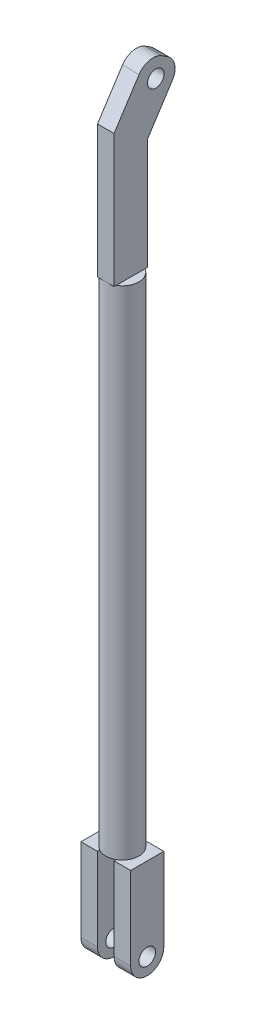
ISO-10303-21;
HEADER;
FILE_DESCRIPTION(('STEP AP214'),'2;1');
FILE_NAME('part.step','',(''),(''),'','','');
FILE_SCHEMA(('AUTOMOTIVE_DESIGN { 1 0 10303 214 1 1 1 1 }'));
ENDSEC;
DATA;
#1=APPLICATION_CONTEXT('core data for automotive mechanical design processes');
#2=APPLICATION_PROTOCOL_DEFINITION('international standard','automotive_design',2000,#1);
#3=PRODUCT_CONTEXT('',#1,'mechanical');
#4=PRODUCT('Part','Part','',(#3));
#5=PRODUCT_RELATED_PRODUCT_CATEGORY('part','',(#4));
#6=PRODUCT_DEFINITION_FORMATION('','',#4);
#7=PRODUCT_DEFINITION_CONTEXT('part definition',#1,'design');
#8=PRODUCT_DEFINITION('design','',#6,#7);
#9=PRODUCT_DEFINITION_SHAPE('','',#8);
#10=(LENGTH_UNIT() NAMED_UNIT(*) SI_UNIT(.MILLI.,.METRE.));
#11=(NAMED_UNIT(*) PLANE_ANGLE_UNIT() SI_UNIT($,.RADIAN.));
#12=(NAMED_UNIT(*) SI_UNIT($,.STERADIAN.) SOLID_ANGLE_UNIT());
#13=UNCERTAINTY_MEASURE_WITH_UNIT(LENGTH_MEASURE(1.E-05),#10,'distance_accuracy_value','');
#14=(GEOMETRIC_REPRESENTATION_CONTEXT(3) GLOBAL_UNCERTAINTY_ASSIGNED_CONTEXT((#13)) GLOBAL_UNIT_ASSIGNED_CONTEXT((#10,
#11,#12)) REPRESENTATION_CONTEXT('',''));
#15=CARTESIAN_POINT('',(0.,0.,0.));
#16=DIRECTION('',(0.,0.,1.));
#17=DIRECTION('',(1.,0.,0.));
#18=AXIS2_PLACEMENT_3D('',#15,#16,#17);
#19=CARTESIAN_POINT('',(0.,190.5,0.));
#20=DIRECTION('',(0.,1.,0.));
#21=DIRECTION('',(0.,0.,1.));
#22=AXIS2_PLACEMENT_3D('',#19,#20,#21);
#23=PLANE('',#22);
#24=CARTESIAN_POINT('',(0.,190.5,0.));
#25=DIRECTION('',(0.,1.,0.));
#26=DIRECTION('',(0.,0.,1.));
#27=AXIS2_PLACEMENT_3D('',#24,#25,#26);
#28=CIRCLE('',#27,12.7);
#29=CARTESIAN_POINT('',(-6.35,190.5,-10.9985226280624));
#30=VERTEX_POINT('',#29);
#31=CARTESIAN_POINT('',(-6.35,190.5,10.9985226280624));
#32=VERTEX_POINT('',#31);
#33=EDGE_CURVE('E392',#30,#32,#28,.T.);
#34=ORIENTED_EDGE('',*,*,#33,.T.);
#35=DIRECTION('',(0.,0.,-1.));
#36=VECTOR('',#35,1.);
#37=CARTESIAN_POINT('',(-6.35,190.5,12.7));
#38=LINE('',#37,#36);
#39=EDGE_CURVE('E268',#32,#30,#38,.T.);
#40=ORIENTED_EDGE('',*,*,#39,.T.);
#41=EDGE_LOOP('',(#34,#40));
#42=FACE_BOUND('',#41,.T.);
#43=ADVANCED_FACE('F30',(#42),#23,.T.);
#44=CARTESIAN_POINT('',(0.,-190.5,0.));
#45=DIRECTION('',(0.,1.,0.));
#46=DIRECTION('',(0.,0.,1.));
#47=AXIS2_PLACEMENT_3D('',#44,#45,#46);
#48=PLANE('',#47);
#49=DIRECTION('',(0.,0.,1.));
#50=VECTOR('',#49,1.);
#51=CARTESIAN_POINT('',(-6.35,-190.5,-12.7));
#52=LINE('',#51,#50);
#53=CARTESIAN_POINT('',(-6.35,-190.5,-10.9985226280624));
#54=VERTEX_POINT('',#53);
#55=CARTESIAN_POINT('',(-6.35,-190.5,10.9985226280624));
#56=VERTEX_POINT('',#55);
#57=EDGE_CURVE('E225',#54,#56,#52,.T.);
#58=ORIENTED_EDGE('',*,*,#57,.F.);
#59=CARTESIAN_POINT('',(0.,-190.5,0.));
#60=DIRECTION('',(0.,1.,0.));
#61=DIRECTION('',(0.,0.,1.));
#62=AXIS2_PLACEMENT_3D('',#59,#60,#61);
#63=CIRCLE('',#62,12.7);
#64=CARTESIAN_POINT('',(6.35,-190.5,-10.9985226280624));
#65=VERTEX_POINT('',#64);
#66=EDGE_CURVE('E264',#65,#54,#63,.T.);
#67=ORIENTED_EDGE('',*,*,#66,.F.);
#68=DIRECTION('',(0.,0.,-1.));
#69=VECTOR('',#68,1.);
#70=CARTESIAN_POINT('',(6.35,-190.5,-12.7));
#71=LINE('',#70,#69);
#72=CARTESIAN_POINT('',(6.35,-190.5,10.9985226280624));
#73=VERTEX_POINT('',#72);
#74=EDGE_CURVE('E247',#73,#65,#71,.T.);
#75=ORIENTED_EDGE('',*,*,#74,.F.);
#76=EDGE_CURVE('E258',#56,#73,#63,.T.);
#77=ORIENTED_EDGE('',*,*,#76,.F.);
#78=EDGE_LOOP('',(#58,#67,#75,#77));
#79=FACE_BOUND('',#78,.T.);
#80=ADVANCED_FACE('F441',(#79),#48,.F.);
#81=CARTESIAN_POINT('',(0.,190.5,0.));
#82=DIRECTION('',(0.,-1.,0.));
#83=DIRECTION('',(0.,0.,-1.));
#84=AXIS2_PLACEMENT_3D('',#81,#82,#83);
#85=CYLINDRICAL_SURFACE('',#84,12.7);
#86=CARTESIAN_POINT('',(0.,190.5,12.7));
#87=VERTEX_POINT('',#86);
#88=CARTESIAN_POINT('',(6.35,190.5,10.9985226280624));
#89=VERTEX_POINT('',#88);
#90=EDGE_CURVE('E187',#87,#89,#28,.T.);
#91=ORIENTED_EDGE('',*,*,#90,.F.);
#92=EDGE_CURVE('E261',#32,#87,#28,.T.);
#93=ORIENTED_EDGE('',*,*,#92,.F.);
#94=ORIENTED_EDGE('',*,*,#33,.F.);
#95=CARTESIAN_POINT('',(6.35,190.5,-10.9985226280624));
#96=VERTEX_POINT('',#95);
#97=EDGE_CURVE('E393',#96,#30,#28,.T.);
#98=ORIENTED_EDGE('',*,*,#97,.F.);
#99=EDGE_CURVE('E260',#89,#96,#28,.T.);
#100=ORIENTED_EDGE('',*,*,#99,.F.);
#101=EDGE_LOOP('',(#91,#93,#94,#98,#100));
#102=FACE_BOUND('',#101,.T.);
#103=EDGE_CURVE('E262',#73,#65,#63,.T.);
#104=ORIENTED_EDGE('',*,*,#103,.T.);
#105=ORIENTED_EDGE('',*,*,#66,.T.);
#106=EDGE_CURVE('E715',#54,#56,#63,.T.);
#107=ORIENTED_EDGE('',*,*,#106,.T.);
#108=ORIENTED_EDGE('',*,*,#76,.T.);
#109=EDGE_LOOP('',(#104,#105,#107,#108));
#110=FACE_BOUND('',#109,.T.);
#111=ADVANCED_FACE('F400',(#102,#110),#85,.T.);
#112=DIRECTION('',(0.,0.,-1.));
#113=VECTOR('',#112,1.);
#114=CARTESIAN_POINT('',(6.35,190.5,12.7));
#115=LINE('',#114,#113);
#116=EDGE_CURVE('E193',#89,#96,#115,.T.);
#117=ORIENTED_EDGE('',*,*,#116,.F.);
#118=ORIENTED_EDGE('',*,*,#99,.T.);
#119=EDGE_LOOP('',(#117,#118));
#120=FACE_BOUND('',#119,.T.);
#121=ADVANCED_FACE('F399',(#120),#23,.T.);
#122=CARTESIAN_POINT('',(19.05,-190.5,12.7));
#123=DIRECTION('',(0.,1.,0.));
#124=DIRECTION('',(0.,0.,1.));
#125=AXIS2_PLACEMENT_3D('',#122,#123,#124);
#126=PLANE('',#125);
#127=ORIENTED_EDGE('',*,*,#103,.F.);
#128=CARTESIAN_POINT('',(6.35,-190.5,12.7));
#129=VERTEX_POINT('',#128);
#130=EDGE_CURVE('E243',#129,#73,#71,.T.);
#131=ORIENTED_EDGE('',*,*,#130,.F.);
#132=DIRECTION('',(-1.,0.,0.));
#133=VECTOR('',#132,1.);
#134=CARTESIAN_POINT('',(6.35,-190.5,12.7));
#135=LINE('',#134,#133);
#136=CARTESIAN_POINT('',(19.05,-190.5,12.7));
#137=VERTEX_POINT('',#136);
#138=EDGE_CURVE('E239',#137,#129,#135,.T.);
#139=ORIENTED_EDGE('',*,*,#138,.F.);
#140=DIRECTION('',(0.,0.,1.));
#141=VECTOR('',#140,1.);
#142=CARTESIAN_POINT('',(19.05,-190.5,-12.7));
#143=LINE('',#142,#141);
#144=CARTESIAN_POINT('',(19.05,-190.5,-12.7));
#145=VERTEX_POINT('',#144);
#146=EDGE_CURVE('E236',#145,#137,#143,.T.);
#147=ORIENTED_EDGE('',*,*,#146,.F.);
#148=DIRECTION('',(1.,0.,0.));
#149=VECTOR('',#148,1.);
#150=CARTESIAN_POINT('',(6.35,-190.5,-12.7));
#151=LINE('',#150,#149);
#152=CARTESIAN_POINT('',(6.35,-190.5,-12.7));
#153=VERTEX_POINT('',#152);
#154=EDGE_CURVE('E246',#153,#145,#151,.T.);
#155=ORIENTED_EDGE('',*,*,#154,.F.);
#156=EDGE_CURVE('E242',#65,#153,#71,.T.);
#157=ORIENTED_EDGE('',*,*,#156,.F.);
#158=EDGE_LOOP('',(#127,#131,#139,#147,#155,#157));
#159=FACE_BOUND('',#158,.T.);
#160=ADVANCED_FACE('F412',(#159),#126,.T.);
#161=CARTESIAN_POINT('',(19.05,-266.7,-12.7));
#162=DIRECTION('',(-1.,0.,0.));
#163=DIRECTION('',(0.,0.,1.));
#164=AXIS2_PLACEMENT_3D('',#161,#162,#163);
#165=PLANE('',#164);
#166=CARTESIAN_POINT('',(19.05,-254.,0.));
#167=DIRECTION('',(-1.,0.,0.));
#168=DIRECTION('',(0.,0.,1.));
#169=AXIS2_PLACEMENT_3D('',#166,#167,#168);
#170=CIRCLE('',#169,6.34999999999999);
#171=CARTESIAN_POINT('',(19.05,-254.,6.34999999999999));
#172=VERTEX_POINT('',#171);
#173=EDGE_CURVE('E317',#172,#172,#170,.T.);
#174=ORIENTED_EDGE('',*,*,#173,.T.);
#175=EDGE_LOOP('',(#174));
#176=FACE_BOUND('',#175,.T.);
#177=CARTESIAN_POINT('',(19.05,-254.,0.));
#178=DIRECTION('',(-1.,0.,0.));
#179=DIRECTION('',(0.,0.,1.));
#180=AXIS2_PLACEMENT_3D('',#177,#178,#179);
#181=CIRCLE('',#180,12.7);
#182=CARTESIAN_POINT('',(19.05,-254.,12.7));
#183=VERTEX_POINT('',#182);
#184=CARTESIAN_POINT('',(19.05,-266.7,0.));
#185=VERTEX_POINT('',#184);
#186=EDGE_CURVE('E295',#183,#185,#181,.F.);
#187=ORIENTED_EDGE('',*,*,#186,.T.);
#188=CARTESIAN_POINT('',(19.05,-254.,0.));
#189=DIRECTION('',(-1.,0.,0.));
#190=DIRECTION('',(0.,0.,1.));
#191=AXIS2_PLACEMENT_3D('',#188,#189,#190);
#192=CIRCLE('',#191,12.7);
#193=CARTESIAN_POINT('',(19.05,-254.,-12.7));
#194=VERTEX_POINT('',#193);
#195=EDGE_CURVE('E297',#185,#194,#192,.F.);
#196=ORIENTED_EDGE('',*,*,#195,.T.);
#197=DIRECTION('',(0.,1.,0.));
#198=VECTOR('',#197,1.);
#199=CARTESIAN_POINT('',(19.05,-266.7,-12.7));
#200=LINE('',#199,#198);
#201=EDGE_CURVE('E250',#194,#145,#200,.T.);
#202=ORIENTED_EDGE('',*,*,#201,.T.);
#203=ORIENTED_EDGE('',*,*,#146,.T.);
#204=DIRECTION('',(0.,1.,0.));
#205=VECTOR('',#204,1.);
#206=CARTESIAN_POINT('',(19.05,-266.7,12.7));
#207=LINE('',#206,#205);
#208=EDGE_CURVE('E256',#183,#137,#207,.T.);
#209=ORIENTED_EDGE('',*,*,#208,.F.);
#210=EDGE_LOOP('',(#187,#196,#202,#203,#209));
#211=FACE_BOUND('',#210,.T.);
#212=ADVANCED_FACE('F429',(#176,#211),#165,.F.);
#213=CARTESIAN_POINT('',(6.35,-266.7,12.7));
#214=DIRECTION('',(0.,0.,-1.));
#215=DIRECTION('',(-1.,0.,0.));
#216=AXIS2_PLACEMENT_3D('',#213,#214,#215);
#217=PLANE('',#216);
#218=DIRECTION('',(0.,1.,0.));
#219=VECTOR('',#218,1.);
#220=CARTESIAN_POINT('',(6.35,-266.7,12.7));
#221=LINE('',#220,#219);
#222=CARTESIAN_POINT('',(6.35,-254.,12.7));
#223=VERTEX_POINT('',#222);
#224=EDGE_CURVE('E254',#223,#129,#221,.T.);
#225=ORIENTED_EDGE('',*,*,#224,.F.);
#226=DIRECTION('',(-1.,0.,0.));
#227=VECTOR('',#226,1.);
#228=CARTESIAN_POINT('',(6.35,-254.,12.7));
#229=LINE('',#228,#227);
#230=EDGE_CURVE('E39',#223,#183,#229,.F.);
#231=ORIENTED_EDGE('',*,*,#230,.T.);
#232=ORIENTED_EDGE('',*,*,#208,.T.);
#233=ORIENTED_EDGE('',*,*,#138,.T.);
#234=EDGE_LOOP('',(#225,#231,#232,#233));
#235=FACE_BOUND('',#234,.T.);
#236=ADVANCED_FACE('F427',(#235),#217,.F.);
#237=CARTESIAN_POINT('',(6.35,-266.7,-12.7));
#238=DIRECTION('',(1.,0.,0.));
#239=DIRECTION('',(0.,0.,-1.));
#240=AXIS2_PLACEMENT_3D('',#237,#238,#239);
#241=PLANE('',#240);
#242=CARTESIAN_POINT('',(6.35,-254.,0.));
#243=DIRECTION('',(1.,0.,0.));
#244=DIRECTION('',(0.,0.,-1.));
#245=AXIS2_PLACEMENT_3D('',#242,#243,#244);
#246=CIRCLE('',#245,6.34999999999999);
#247=CARTESIAN_POINT('',(6.35,-254.,-6.35));
#248=VERTEX_POINT('',#247);
#249=EDGE_CURVE('E322',#248,#248,#246,.T.);
#250=ORIENTED_EDGE('',*,*,#249,.T.);
#251=EDGE_LOOP('',(#250));
#252=FACE_BOUND('',#251,.T.);
#253=DIRECTION('',(0.,1.,0.));
#254=VECTOR('',#253,1.);
#255=CARTESIAN_POINT('',(6.35,-266.7,-12.7));
#256=LINE('',#255,#254);
#257=CARTESIAN_POINT('',(6.35,-254.,-12.7));
#258=VERTEX_POINT('',#257);
#259=EDGE_CURVE('E252',#258,#153,#256,.T.);
#260=ORIENTED_EDGE('',*,*,#259,.F.);
#261=CARTESIAN_POINT('',(6.35,-254.,0.));
#262=DIRECTION('',(1.,0.,0.));
#263=DIRECTION('',(0.,0.,-1.));
#264=AXIS2_PLACEMENT_3D('',#261,#262,#263);
#265=CIRCLE('',#264,12.7);
#266=CARTESIAN_POINT('',(6.35,-266.7,0.));
#267=VERTEX_POINT('',#266);
#268=EDGE_CURVE('E52',#258,#267,#265,.F.);
#269=ORIENTED_EDGE('',*,*,#268,.T.);
#270=CARTESIAN_POINT('',(6.35,-254.,0.));
#271=DIRECTION('',(1.,0.,0.));
#272=DIRECTION('',(0.,0.,-1.));
#273=AXIS2_PLACEMENT_3D('',#270,#271,#272);
#274=CIRCLE('',#273,12.7);
#275=EDGE_CURVE('E47',#267,#223,#274,.F.);
#276=ORIENTED_EDGE('',*,*,#275,.T.);
#277=ORIENTED_EDGE('',*,*,#224,.T.);
#278=ORIENTED_EDGE('',*,*,#130,.T.);
#279=ORIENTED_EDGE('',*,*,#74,.T.);
#280=ORIENTED_EDGE('',*,*,#156,.T.);
#281=EDGE_LOOP('',(#260,#269,#276,#277,#278,#279,#280));
#282=FACE_BOUND('',#281,.T.);
#283=ADVANCED_FACE('F408',(#252,#282),#241,.F.);
#284=CARTESIAN_POINT('',(6.35,-266.7,-12.7));
#285=DIRECTION('',(0.,0.,1.));
#286=DIRECTION('',(1.,0.,0.));
#287=AXIS2_PLACEMENT_3D('',#284,#285,#286);
#288=PLANE('',#287);
#289=ORIENTED_EDGE('',*,*,#201,.F.);
#290=DIRECTION('',(1.,0.,0.));
#291=VECTOR('',#290,1.);
#292=CARTESIAN_POINT('',(6.35,-254.,-12.7));
#293=LINE('',#292,#291);
#294=EDGE_CURVE('E299',#194,#258,#293,.F.);
#295=ORIENTED_EDGE('',*,*,#294,.T.);
#296=ORIENTED_EDGE('',*,*,#259,.T.);
#297=ORIENTED_EDGE('',*,*,#154,.T.);
#298=EDGE_LOOP('',(#289,#295,#296,#297));
#299=FACE_BOUND('',#298,.T.);
#300=ADVANCED_FACE('F416',(#299),#288,.F.);
#301=CARTESIAN_POINT('',(-19.05,-190.5,12.7));
#302=DIRECTION('',(0.,1.,0.));
#303=DIRECTION('',(0.,0.,1.));
#304=AXIS2_PLACEMENT_3D('',#301,#302,#303);
#305=PLANE('',#304);
#306=ORIENTED_EDGE('',*,*,#106,.F.);
#307=CARTESIAN_POINT('',(-6.35,-190.5,-12.7));
#308=VERTEX_POINT('',#307);
#309=EDGE_CURVE('E221',#308,#54,#52,.T.);
#310=ORIENTED_EDGE('',*,*,#309,.F.);
#311=DIRECTION('',(1.,0.,0.));
#312=VECTOR('',#311,1.);
#313=CARTESIAN_POINT('',(-19.05,-190.5,-12.7));
#314=LINE('',#313,#312);
#315=CARTESIAN_POINT('',(-19.05,-190.5,-12.7));
#316=VERTEX_POINT('',#315);
#317=EDGE_CURVE('E212',#316,#308,#314,.T.);
#318=ORIENTED_EDGE('',*,*,#317,.F.);
#319=DIRECTION('',(0.,0.,-1.));
#320=VECTOR('',#319,1.);
#321=CARTESIAN_POINT('',(-19.05,-190.5,-12.7));
#322=LINE('',#321,#320);
#323=CARTESIAN_POINT('',(-19.05,-190.5,12.7));
#324=VERTEX_POINT('',#323);
#325=EDGE_CURVE('E209',#324,#316,#322,.T.);
#326=ORIENTED_EDGE('',*,*,#325,.F.);
#327=DIRECTION('',(-1.,0.,0.));
#328=VECTOR('',#327,1.);
#329=CARTESIAN_POINT('',(-19.05,-190.5,12.7));
#330=LINE('',#329,#328);
#331=CARTESIAN_POINT('',(-6.35,-190.5,12.7));
#332=VERTEX_POINT('',#331);
#333=EDGE_CURVE('E224',#332,#324,#330,.T.);
#334=ORIENTED_EDGE('',*,*,#333,.F.);
#335=EDGE_CURVE('E220',#56,#332,#52,.T.);
#336=ORIENTED_EDGE('',*,*,#335,.F.);
#337=EDGE_LOOP('',(#306,#310,#318,#326,#334,#336));
#338=FACE_BOUND('',#337,.T.);
#339=ADVANCED_FACE('F586',(#338),#305,.T.);
#340=CARTESIAN_POINT('',(-19.05,-266.7,-12.7));
#341=DIRECTION('',(1.,0.,0.));
#342=DIRECTION('',(0.,0.,-1.));
#343=AXIS2_PLACEMENT_3D('',#340,#341,#342);
#344=PLANE('',#343);
#345=CARTESIAN_POINT('',(-19.05,-254.,0.));
#346=DIRECTION('',(-1.,0.,0.));
#347=DIRECTION('',(0.,0.,1.));
#348=AXIS2_PLACEMENT_3D('',#345,#346,#347);
#349=CIRCLE('',#348,6.34999999999999);
#350=CARTESIAN_POINT('',(-19.05,-254.,6.34999999999999));
#351=VERTEX_POINT('',#350);
#352=EDGE_CURVE('E699',#351,#351,#349,.T.);
#353=ORIENTED_EDGE('',*,*,#352,.F.);
#354=EDGE_LOOP('',(#353));
#355=FACE_BOUND('',#354,.T.);
#356=DIRECTION('',(0.,1.,0.));
#357=VECTOR('',#356,1.);
#358=CARTESIAN_POINT('',(-19.05,-266.7,-12.7));
#359=LINE('',#358,#357);
#360=CARTESIAN_POINT('',(-19.05,-254.,-12.7));
#361=VERTEX_POINT('',#360);
#362=EDGE_CURVE('E234',#361,#316,#359,.T.);
#363=ORIENTED_EDGE('',*,*,#362,.F.);
#364=CARTESIAN_POINT('',(-19.05,-254.,0.));
#365=DIRECTION('',(1.,0.,0.));
#366=DIRECTION('',(0.,0.,-1.));
#367=AXIS2_PLACEMENT_3D('',#364,#365,#366);
#368=CIRCLE('',#367,12.7);
#369=CARTESIAN_POINT('',(-19.05,-266.7,0.));
#370=VERTEX_POINT('',#369);
#371=EDGE_CURVE('E293',#361,#370,#368,.F.);
#372=ORIENTED_EDGE('',*,*,#371,.T.);
#373=CARTESIAN_POINT('',(-19.05,-254.,0.));
#374=DIRECTION('',(1.,0.,0.));
#375=DIRECTION('',(0.,0.,-1.));
#376=AXIS2_PLACEMENT_3D('',#373,#374,#375);
#377=CIRCLE('',#376,12.7);
#378=CARTESIAN_POINT('',(-19.05,-254.,12.7));
#379=VERTEX_POINT('',#378);
#380=EDGE_CURVE('E291',#370,#379,#377,.F.);
#381=ORIENTED_EDGE('',*,*,#380,.T.);
#382=DIRECTION('',(0.,1.,0.));
#383=VECTOR('',#382,1.);
#384=CARTESIAN_POINT('',(-19.05,-266.7,12.7));
#385=LINE('',#384,#383);
#386=EDGE_CURVE('E228',#379,#324,#385,.T.);
#387=ORIENTED_EDGE('',*,*,#386,.T.);
#388=ORIENTED_EDGE('',*,*,#325,.T.);
#389=EDGE_LOOP('',(#363,#372,#381,#387,#388));
#390=FACE_BOUND('',#389,.T.);
#391=ADVANCED_FACE('F578',(#355,#390),#344,.F.);
#392=CARTESIAN_POINT('',(-19.05,-266.7,-12.7));
#393=DIRECTION('',(0.,0.,1.));
#394=DIRECTION('',(1.,0.,0.));
#395=AXIS2_PLACEMENT_3D('',#392,#393,#394);
#396=PLANE('',#395);
#397=DIRECTION('',(0.,1.,0.));
#398=VECTOR('',#397,1.);
#399=CARTESIAN_POINT('',(-6.35,-266.7,-12.7));
#400=LINE('',#399,#398);
#401=CARTESIAN_POINT('',(-6.35,-254.,-12.7));
#402=VERTEX_POINT('',#401);
#403=EDGE_CURVE('E232',#402,#308,#400,.T.);
#404=ORIENTED_EDGE('',*,*,#403,.F.);
#405=DIRECTION('',(1.,0.,0.));
#406=VECTOR('',#405,1.);
#407=CARTESIAN_POINT('',(-19.05,-254.,-12.7));
#408=LINE('',#407,#406);
#409=EDGE_CURVE('E288',#402,#361,#408,.F.);
#410=ORIENTED_EDGE('',*,*,#409,.T.);
#411=ORIENTED_EDGE('',*,*,#362,.T.);
#412=ORIENTED_EDGE('',*,*,#317,.T.);
#413=EDGE_LOOP('',(#404,#410,#411,#412));
#414=FACE_BOUND('',#413,.T.);
#415=ADVANCED_FACE('F570',(#414),#396,.F.);
#416=CARTESIAN_POINT('',(-6.35,-266.7,-12.7));
#417=DIRECTION('',(-1.,0.,0.));
#418=DIRECTION('',(0.,0.,1.));
#419=AXIS2_PLACEMENT_3D('',#416,#417,#418);
#420=PLANE('',#419);
#421=CARTESIAN_POINT('',(-6.35,-254.,0.));
#422=DIRECTION('',(-1.,0.,0.));
#423=DIRECTION('',(0.,0.,1.));
#424=AXIS2_PLACEMENT_3D('',#421,#422,#423);
#425=CIRCLE('',#424,6.34999999999999);
#426=CARTESIAN_POINT('',(-6.35,-254.,6.34999999999999));
#427=VERTEX_POINT('',#426);
#428=EDGE_CURVE('E34',#427,#427,#425,.T.);
#429=ORIENTED_EDGE('',*,*,#428,.T.);
#430=EDGE_LOOP('',(#429));
#431=FACE_BOUND('',#430,.T.);
#432=CARTESIAN_POINT('',(-6.35,-254.,0.));
#433=DIRECTION('',(-1.,0.,0.));
#434=DIRECTION('',(0.,0.,1.));
#435=AXIS2_PLACEMENT_3D('',#432,#433,#434);
#436=CIRCLE('',#435,12.7);
#437=CARTESIAN_POINT('',(-6.35,-254.,12.7));
#438=VERTEX_POINT('',#437);
#439=CARTESIAN_POINT('',(-6.35,-266.7,0.));
#440=VERTEX_POINT('',#439);
#441=EDGE_CURVE('E284',#438,#440,#436,.F.);
#442=ORIENTED_EDGE('',*,*,#441,.T.);
#443=CARTESIAN_POINT('',(-6.35,-254.,0.));
#444=DIRECTION('',(-1.,0.,0.));
#445=DIRECTION('',(0.,0.,1.));
#446=AXIS2_PLACEMENT_3D('',#443,#444,#445);
#447=CIRCLE('',#446,12.7);
#448=EDGE_CURVE('E286',#440,#402,#447,.F.);
#449=ORIENTED_EDGE('',*,*,#448,.T.);
#450=ORIENTED_EDGE('',*,*,#403,.T.);
#451=ORIENTED_EDGE('',*,*,#309,.T.);
#452=ORIENTED_EDGE('',*,*,#57,.T.);
#453=ORIENTED_EDGE('',*,*,#335,.T.);
#454=DIRECTION('',(0.,1.,0.));
#455=VECTOR('',#454,1.);
#456=CARTESIAN_POINT('',(-6.35,-266.7,12.7));
#457=LINE('',#456,#455);
#458=EDGE_CURVE('E230',#438,#332,#457,.T.);
#459=ORIENTED_EDGE('',*,*,#458,.F.);
#460=EDGE_LOOP('',(#442,#449,#450,#451,#452,#453,#459));
#461=FACE_BOUND('',#460,.T.);
#462=ADVANCED_FACE('F562',(#431,#461),#420,.F.);
#463=CARTESIAN_POINT('',(-19.05,-266.7,12.7));
#464=DIRECTION('',(0.,0.,-1.));
#465=DIRECTION('',(-1.,0.,0.));
#466=AXIS2_PLACEMENT_3D('',#463,#464,#465);
#467=PLANE('',#466);
#468=ORIENTED_EDGE('',*,*,#386,.F.);
#469=DIRECTION('',(-1.,0.,0.));
#470=VECTOR('',#469,1.);
#471=CARTESIAN_POINT('',(-19.05,-254.,12.7));
#472=LINE('',#471,#470);
#473=EDGE_CURVE('E11',#379,#438,#472,.F.);
#474=ORIENTED_EDGE('',*,*,#473,.T.);
#475=ORIENTED_EDGE('',*,*,#458,.T.);
#476=ORIENTED_EDGE('',*,*,#333,.T.);
#477=EDGE_LOOP('',(#468,#474,#475,#476));
#478=FACE_BOUND('',#477,.T.);
#479=ADVANCED_FACE('F557',(#478),#467,.F.);
#480=CARTESIAN_POINT('',(6.35,190.5,12.7));
#481=DIRECTION('',(0.,1.,0.));
#482=DIRECTION('',(0.,0.,1.));
#483=AXIS2_PLACEMENT_3D('',#480,#481,#482);
#484=PLANE('',#483);
#485=CARTESIAN_POINT('',(6.35,190.5,-12.8862828907296));
#486=VERTEX_POINT('',#485);
#487=EDGE_CURVE('E191',#96,#486,#115,.T.);
#488=ORIENTED_EDGE('',*,*,#487,.F.);
#489=ORIENTED_EDGE('',*,*,#97,.T.);
#490=CARTESIAN_POINT('',(-6.35,190.5,-12.8862828907296));
#491=VERTEX_POINT('',#490);
#492=EDGE_CURVE('E335',#30,#491,#38,.T.);
#493=ORIENTED_EDGE('',*,*,#492,.T.);
#494=DIRECTION('',(-1.,0.,0.));
#495=VECTOR('',#494,1.);
#496=CARTESIAN_POINT('',(6.35,190.5,-12.8862828907296));
#497=LINE('',#496,#495);
#498=EDGE_CURVE('E214',#486,#491,#497,.T.);
#499=ORIENTED_EDGE('',*,*,#498,.F.);
#500=EDGE_LOOP('',(#488,#489,#493,#499));
#501=FACE_BOUND('',#500,.T.);
#502=ADVANCED_FACE('F402',(#501),#484,.F.);
#503=DIRECTION('',(-1.,0.,0.));
#504=VECTOR('',#503,1.);
#505=CARTESIAN_POINT('',(6.35,190.5,12.7));
#506=LINE('',#505,#504);
#507=CARTESIAN_POINT('',(6.35,190.5,12.7));
#508=VERTEX_POINT('',#507);
#509=EDGE_CURVE('E186',#508,#87,#506,.T.);
#510=ORIENTED_EDGE('',*,*,#509,.T.);
#511=ORIENTED_EDGE('',*,*,#90,.T.);
#512=EDGE_CURVE('E182',#508,#89,#115,.T.);
#513=ORIENTED_EDGE('',*,*,#512,.F.);
#514=EDGE_LOOP('',(#510,#511,#513));
#515=FACE_BOUND('',#514,.T.);
#516=ADVANCED_FACE('F184',(#515),#484,.F.);
#517=CARTESIAN_POINT('',(-6.35,190.5,12.7));
#518=VERTEX_POINT('',#517);
#519=EDGE_CURVE('E336',#518,#32,#38,.T.);
#520=ORIENTED_EDGE('',*,*,#519,.T.);
#521=ORIENTED_EDGE('',*,*,#92,.T.);
#522=EDGE_CURVE('E208',#87,#518,#506,.T.);
#523=ORIENTED_EDGE('',*,*,#522,.T.);
#524=EDGE_LOOP('',(#520,#521,#523));
#525=FACE_BOUND('',#524,.T.);
#526=ADVANCED_FACE('F388',(#525),#484,.F.);
#527=CARTESIAN_POINT('',(6.35,190.5,12.7));
#528=DIRECTION('',(0.,0.,-1.));
#529=DIRECTION('',(-1.,0.,0.));
#530=AXIS2_PLACEMENT_3D('',#527,#528,#529);
#531=PLANE('',#530);
#532=DIRECTION('',(0.,-1.,0.));
#533=VECTOR('',#532,1.);
#534=CARTESIAN_POINT('',(-6.35,190.5,12.7));
#535=LINE('',#534,#533);
#536=CARTESIAN_POINT('',(-6.35,292.1,12.7));
#537=VERTEX_POINT('',#536);
#538=EDGE_CURVE('E308',#537,#518,#535,.T.);
#539=ORIENTED_EDGE('',*,*,#538,.T.);
#540=ORIENTED_EDGE('',*,*,#522,.F.);
#541=ORIENTED_EDGE('',*,*,#509,.F.);
#542=DIRECTION('',(0.,-1.,0.));
#543=VECTOR('',#542,1.);
#544=CARTESIAN_POINT('',(6.35,190.5,12.7));
#545=LINE('',#544,#543);
#546=CARTESIAN_POINT('',(6.35,292.1,12.7));
#547=VERTEX_POINT('',#546);
#548=EDGE_CURVE('E195',#547,#508,#545,.T.);
#549=ORIENTED_EDGE('',*,*,#548,.F.);
#550=DIRECTION('',(-1.,0.,0.));
#551=VECTOR('',#550,1.);
#552=CARTESIAN_POINT('',(6.35,292.1,12.7));
#553=LINE('',#552,#551);
#554=EDGE_CURVE('E333',#547,#537,#553,.T.);
#555=ORIENTED_EDGE('',*,*,#554,.T.);
#556=EDGE_LOOP('',(#539,#540,#541,#549,#555));
#557=FACE_BOUND('',#556,.T.);
#558=ADVANCED_FACE('F207',(#557),#531,.F.);
#559=CARTESIAN_POINT('',(6.35,190.5,-12.8862828907296));
#560=DIRECTION('',(0.,0.,1.));
#561=DIRECTION('',(0.,-1.,0.));
#562=AXIS2_PLACEMENT_3D('',#559,#560,#561);
#563=PLANE('',#562);
#564=DIRECTION('',(0.,1.,0.));
#565=VECTOR('',#564,1.);
#566=CARTESIAN_POINT('',(-6.35,190.5,-12.8862828907296));
#567=LINE('',#566,#565);
#568=CARTESIAN_POINT('',(-6.35,275.535805850101,-12.8862828907296));
#569=VERTEX_POINT('',#568);
#570=EDGE_CURVE('E339',#491,#569,#567,.T.);
#571=ORIENTED_EDGE('',*,*,#570,.T.);
#572=DIRECTION('',(-1.,0.,0.));
#573=VECTOR('',#572,1.);
#574=CARTESIAN_POINT('',(6.35,275.535805850101,-12.8862828907296));
#575=LINE('',#574,#573);
#576=CARTESIAN_POINT('',(6.35,275.535805850101,-12.8862828907296));
#577=VERTEX_POINT('',#576);
#578=EDGE_CURVE('E348',#577,#569,#575,.T.);
#579=ORIENTED_EDGE('',*,*,#578,.F.);
#580=DIRECTION('',(0.,1.,0.));
#581=VECTOR('',#580,1.);
#582=CARTESIAN_POINT('',(6.35,190.5,-12.8862828907296));
#583=LINE('',#582,#581);
#584=EDGE_CURVE('E190',#486,#577,#583,.T.);
#585=ORIENTED_EDGE('',*,*,#584,.F.);
#586=ORIENTED_EDGE('',*,*,#498,.T.);
#587=EDGE_LOOP('',(#571,#579,#585,#586));
#588=FACE_BOUND('',#587,.T.);
#589=ADVANCED_FACE('F359',(#588),#563,.F.);
#590=CARTESIAN_POINT('',(6.35,275.535805850101,-12.8862828907296));
#591=DIRECTION('',(0.,0.543444689957327,0.839444976729973));
#592=DIRECTION('',(0.,-0.839444976729973,0.543444689957327));
#593=AXIS2_PLACEMENT_3D('',#590,#591,#592);
#594=PLANE('',#593);
#595=DIRECTION('',(0.,0.839444976729973,-0.543444689957327));
#596=VECTOR('',#595,1.);
#597=CARTESIAN_POINT('',(-6.35,275.535805850101,-12.8862828907296));
#598=LINE('',#597,#596);
#599=CARTESIAN_POINT('',(-6.35,305.057677110842,-31.998320747875));
#600=VERTEX_POINT('',#599);
#601=EDGE_CURVE('E341',#569,#600,#598,.T.);
#602=ORIENTED_EDGE('',*,*,#601,.T.);
#603=DIRECTION('',(-1.,0.,0.));
#604=VECTOR('',#603,1.);
#605=CARTESIAN_POINT('',(6.35,305.057677110842,-31.998320747875));
#606=LINE('',#605,#604);
#607=CARTESIAN_POINT('',(6.35,305.057677110842,-31.998320747875));
#608=VERTEX_POINT('',#607);
#609=EDGE_CURVE('E275',#600,#608,#606,.F.);
#610=ORIENTED_EDGE('',*,*,#609,.T.);
#611=DIRECTION('',(0.,0.839444976729973,-0.543444689957327));
#612=VECTOR('',#611,1.);
#613=CARTESIAN_POINT('',(6.35,275.535805850101,-12.8862828907296));
#614=LINE('',#613,#612);
#615=EDGE_CURVE('E327',#577,#608,#614,.T.);
#616=ORIENTED_EDGE('',*,*,#615,.F.);
#617=ORIENTED_EDGE('',*,*,#578,.T.);
#618=EDGE_LOOP('',(#602,#610,#616,#617));
#619=FACE_BOUND('',#618,.T.);
#620=ADVANCED_FACE('F368',(#619),#594,.F.);
#621=CARTESIAN_POINT('',(6.35,315.718628315313,-38.900068310333));
#622=DIRECTION('',(0.,-0.839444976729974,0.543444689957326));
#623=DIRECTION('',(0.,-0.543444689957326,-0.839444976729974));
#624=AXIS2_PLACEMENT_3D('',#621,#622,#623);
#625=PLANE('',#624);
#626=DIRECTION('',(0.,0.543444689957326,0.839444976729974));
#627=VECTOR('',#626,1.);
#628=CARTESIAN_POINT('',(6.35,315.718628315313,-38.900068310333));
#629=LINE('',#628,#627);
#630=CARTESIAN_POINT('',(6.35,322.620375877771,-28.2391171058624));
#631=VERTEX_POINT('',#630);
#632=CARTESIAN_POINT('',(6.35,325.381074902754,-23.9747366240741));
#633=VERTEX_POINT('',#632);
#634=EDGE_CURVE('E329',#631,#633,#629,.T.);
#635=ORIENTED_EDGE('',*,*,#634,.F.);
#636=DIRECTION('',(-1.,0.,0.));
#637=VECTOR('',#636,1.);
#638=CARTESIAN_POINT('',(6.35,322.620375877771,-28.2391171058624));
#639=LINE('',#638,#637);
#640=CARTESIAN_POINT('',(-6.35,322.620375877771,-28.2391171058624));
#641=VERTEX_POINT('',#640);
#642=EDGE_CURVE('E267',#631,#641,#639,.T.);
#643=ORIENTED_EDGE('',*,*,#642,.T.);
#644=DIRECTION('',(0.,0.543444689957326,0.839444976729974));
#645=VECTOR('',#644,1.);
#646=CARTESIAN_POINT('',(-6.35,315.718628315313,-38.900068310333));
#647=LINE('',#646,#645);
#648=CARTESIAN_POINT('',(-6.35,325.381074902754,-23.9747366240741));
#649=VERTEX_POINT('',#648);
#650=EDGE_CURVE('E344',#641,#649,#647,.T.);
#651=ORIENTED_EDGE('',*,*,#650,.T.);
#652=DIRECTION('',(-1.,0.,0.));
#653=VECTOR('',#652,1.);
#654=CARTESIAN_POINT('',(6.35,325.381074902754,-23.9747366240741));
#655=LINE('',#654,#653);
#656=EDGE_CURVE('E265',#649,#633,#655,.F.);
#657=ORIENTED_EDGE('',*,*,#656,.T.);
#658=EDGE_LOOP('',(#635,#643,#651,#657));
#659=FACE_BOUND('',#658,.T.);
#660=ADVANCED_FACE('F376',(#659),#625,.F.);
#661=CARTESIAN_POINT('',(6.35,292.1,12.7));
#662=DIRECTION('',(0.,-0.543444689957327,-0.839444976729973));
#663=DIRECTION('',(0.,0.839444976729973,-0.543444689957327));
#664=AXIS2_PLACEMENT_3D('',#661,#662,#663);
#665=PLANE('',#664);
#666=DIRECTION('',(0.,-0.839444976729973,0.543444689957327));
#667=VECTOR('',#666,1.);
#668=CARTESIAN_POINT('',(6.35,292.1,12.7));
#669=LINE('',#668,#667);
#670=CARTESIAN_POINT('',(6.35,321.621871260741,-6.41203785714536));
#671=VERTEX_POINT('',#670);
#672=EDGE_CURVE('E199',#671,#547,#669,.T.);
#673=ORIENTED_EDGE('',*,*,#672,.F.);
#674=DIRECTION('',(-1.,0.,0.));
#675=VECTOR('',#674,1.);
#676=CARTESIAN_POINT('',(6.35,321.621871260741,-6.41203785714536));
#677=LINE('',#676,#675);
#678=CARTESIAN_POINT('',(-6.35,321.621871260741,-6.41203785714536));
#679=VERTEX_POINT('',#678);
#680=EDGE_CURVE('E281',#671,#679,#677,.T.);
#681=ORIENTED_EDGE('',*,*,#680,.T.);
#682=DIRECTION('',(0.,-0.839444976729973,0.543444689957327));
#683=VECTOR('',#682,1.);
#684=CARTESIAN_POINT('',(-6.35,292.1,12.7));
#685=LINE('',#684,#683);
#686=EDGE_CURVE('E203',#679,#537,#685,.T.);
#687=ORIENTED_EDGE('',*,*,#686,.T.);
#688=ORIENTED_EDGE('',*,*,#554,.F.);
#689=EDGE_LOOP('',(#673,#681,#687,#688));
#690=FACE_BOUND('',#689,.T.);
#691=ADVANCED_FACE('F382',(#690),#665,.F.);
#692=CARTESIAN_POINT('',(6.35,190.5,12.7));
#693=DIRECTION('',(-1.,0.,0.));
#694=DIRECTION('',(0.,0.,1.));
#695=AXIS2_PLACEMENT_3D('',#692,#693,#694);
#696=PLANE('',#695);
#697=CARTESIAN_POINT('',(6.35,312.593097601459,-19.2668791179152));
#698=DIRECTION('',(1.,0.,0.));
#699=DIRECTION('',(0.,0.,-1.));
#700=AXIS2_PLACEMENT_3D('',#697,#698,#699);
#701=CIRCLE('',#700,6.34999999999997);
#702=CARTESIAN_POINT('',(6.35,312.593097601459,-25.6168791179152));
#703=VERTEX_POINT('',#702);
#704=EDGE_CURVE('E313',#703,#703,#701,.T.);
#705=ORIENTED_EDGE('',*,*,#704,.F.);
#706=EDGE_LOOP('',(#705));
#707=FACE_BOUND('',#706,.T.);
#708=ORIENTED_EDGE('',*,*,#615,.T.);
#709=CARTESIAN_POINT('',(6.35,311.9594246733,-21.3373695434043));
#710=DIRECTION('',(-1.,0.,0.));
#711=DIRECTION('',(0.,0.,1.));
#712=AXIS2_PLACEMENT_3D('',#709,#710,#711);
#713=CIRCLE('',#712,12.7);
#714=EDGE_CURVE('E279',#608,#631,#713,.F.);
#715=ORIENTED_EDGE('',*,*,#714,.T.);
#716=ORIENTED_EDGE('',*,*,#634,.T.);
#717=CARTESIAN_POINT('',(6.35,314.720123698283,-17.072989061616));
#718=DIRECTION('',(-1.,0.,0.));
#719=DIRECTION('',(0.,0.,1.));
#720=AXIS2_PLACEMENT_3D('',#717,#718,#719);
#721=CIRCLE('',#720,12.7);
#722=EDGE_CURVE('E277',#633,#671,#721,.F.);
#723=ORIENTED_EDGE('',*,*,#722,.T.);
#724=ORIENTED_EDGE('',*,*,#672,.T.);
#725=ORIENTED_EDGE('',*,*,#548,.T.);
#726=ORIENTED_EDGE('',*,*,#512,.T.);
#727=ORIENTED_EDGE('',*,*,#116,.T.);
#728=ORIENTED_EDGE('',*,*,#487,.T.);
#729=ORIENTED_EDGE('',*,*,#584,.T.);
#730=EDGE_LOOP('',(#708,#715,#716,#723,#724,#725,#726,#727,#728,#729));
#731=FACE_BOUND('',#730,.T.);
#732=ADVANCED_FACE('F197',(#707,#731),#696,.F.);
#733=CARTESIAN_POINT('',(-6.35,190.5,12.7));
#734=DIRECTION('',(-1.,0.,0.));
#735=DIRECTION('',(0.,0.,1.));
#736=AXIS2_PLACEMENT_3D('',#733,#734,#735);
#737=PLANE('',#736);
#738=CARTESIAN_POINT('',(-6.35,312.593097601459,-19.2668791179152));
#739=DIRECTION('',(-1.,0.,0.));
#740=DIRECTION('',(0.,0.,1.));
#741=AXIS2_PLACEMENT_3D('',#738,#739,#740);
#742=CIRCLE('',#741,6.34999999999997);
#743=CARTESIAN_POINT('',(-6.35,312.593097601459,-12.9168791179153));
#744=VERTEX_POINT('',#743);
#745=EDGE_CURVE('E311',#744,#744,#742,.T.);
#746=ORIENTED_EDGE('',*,*,#745,.F.);
#747=EDGE_LOOP('',(#746));
#748=FACE_BOUND('',#747,.T.);
#749=ORIENTED_EDGE('',*,*,#650,.F.);
#750=CARTESIAN_POINT('',(-6.35,311.9594246733,-21.3373695434043));
#751=DIRECTION('',(-1.,0.,0.));
#752=DIRECTION('',(0.,0.,1.));
#753=AXIS2_PLACEMENT_3D('',#750,#751,#752);
#754=CIRCLE('',#753,12.7);
#755=EDGE_CURVE('E273',#641,#600,#754,.T.);
#756=ORIENTED_EDGE('',*,*,#755,.T.);
#757=ORIENTED_EDGE('',*,*,#601,.F.);
#758=ORIENTED_EDGE('',*,*,#570,.F.);
#759=ORIENTED_EDGE('',*,*,#492,.F.);
#760=ORIENTED_EDGE('',*,*,#39,.F.);
#761=ORIENTED_EDGE('',*,*,#519,.F.);
#762=ORIENTED_EDGE('',*,*,#538,.F.);
#763=ORIENTED_EDGE('',*,*,#686,.F.);
#764=CARTESIAN_POINT('',(-6.35,314.720123698283,-17.072989061616));
#765=DIRECTION('',(-1.,0.,0.));
#766=DIRECTION('',(0.,0.,1.));
#767=AXIS2_PLACEMENT_3D('',#764,#765,#766);
#768=CIRCLE('',#767,12.7);
#769=EDGE_CURVE('E271',#679,#649,#768,.T.);
#770=ORIENTED_EDGE('',*,*,#769,.T.);
#771=EDGE_LOOP('',(#749,#756,#757,#758,#759,#760,#761,#762,#763,#770));
#772=FACE_BOUND('',#771,.T.);
#773=ADVANCED_FACE('F365',(#748,#772),#737,.T.);
#774=CARTESIAN_POINT('',(6.35,311.9594246733,-21.3373695434043));
#775=DIRECTION('',(-1.,0.,0.));
#776=DIRECTION('',(0.,0.,1.));
#777=AXIS2_PLACEMENT_3D('',#774,#775,#776);
#778=CYLINDRICAL_SURFACE('',#777,12.7);
#779=ORIENTED_EDGE('',*,*,#714,.F.);
#780=ORIENTED_EDGE('',*,*,#609,.F.);
#781=ORIENTED_EDGE('',*,*,#755,.F.);
#782=ORIENTED_EDGE('',*,*,#642,.F.);
#783=EDGE_LOOP('',(#779,#780,#781,#782));
#784=FACE_BOUND('',#783,.T.);
#785=ADVANCED_FACE('F371',(#784),#778,.T.);
#786=CARTESIAN_POINT('',(6.35,314.720123698283,-17.072989061616));
#787=DIRECTION('',(-1.,0.,0.));
#788=DIRECTION('',(0.,0.,1.));
#789=AXIS2_PLACEMENT_3D('',#786,#787,#788);
#790=CYLINDRICAL_SURFACE('',#789,12.7);
#791=ORIENTED_EDGE('',*,*,#722,.F.);
#792=ORIENTED_EDGE('',*,*,#656,.F.);
#793=ORIENTED_EDGE('',*,*,#769,.F.);
#794=ORIENTED_EDGE('',*,*,#680,.F.);
#795=EDGE_LOOP('',(#791,#792,#793,#794));
#796=FACE_BOUND('',#795,.T.);
#797=ADVANCED_FACE('F379',(#796),#790,.T.);
#798=CARTESIAN_POINT('',(-19.05,-254.,0.));
#799=DIRECTION('',(-1.,0.,0.));
#800=DIRECTION('',(0.,0.,1.));
#801=AXIS2_PLACEMENT_3D('',#798,#799,#800);
#802=CYLINDRICAL_SURFACE('',#801,12.7);
#803=ORIENTED_EDGE('',*,*,#473,.F.);
#804=ORIENTED_EDGE('',*,*,#380,.F.);
#805=DIRECTION('',(-1.,0.,0.));
#806=VECTOR('',#805,1.);
#807=CARTESIAN_POINT('',(-19.05,-266.7,0.));
#808=LINE('',#807,#806);
#809=EDGE_CURVE('E305',#440,#370,#808,.T.);
#810=ORIENTED_EDGE('',*,*,#809,.F.);
#811=ORIENTED_EDGE('',*,*,#441,.F.);
#812=EDGE_LOOP('',(#803,#804,#810,#811));
#813=FACE_BOUND('',#812,.T.);
#814=ADVANCED_FACE('F459',(#813),#802,.T.);
#815=CARTESIAN_POINT('',(-19.05,-254.,0.));
#816=DIRECTION('',(1.,0.,0.));
#817=DIRECTION('',(0.,0.,-1.));
#818=AXIS2_PLACEMENT_3D('',#815,#816,#817);
#819=CYLINDRICAL_SURFACE('',#818,12.7);
#820=ORIENTED_EDGE('',*,*,#371,.F.);
#821=ORIENTED_EDGE('',*,*,#409,.F.);
#822=ORIENTED_EDGE('',*,*,#448,.F.);
#823=ORIENTED_EDGE('',*,*,#809,.T.);
#824=EDGE_LOOP('',(#820,#821,#822,#823));
#825=FACE_BOUND('',#824,.T.);
#826=ADVANCED_FACE('F460',(#825),#819,.T.);
#827=CARTESIAN_POINT('',(19.05,-254.,0.));
#828=DIRECTION('',(-1.,0.,0.));
#829=DIRECTION('',(0.,0.,1.));
#830=AXIS2_PLACEMENT_3D('',#827,#828,#829);
#831=CYLINDRICAL_SURFACE('',#830,12.7);
#832=ORIENTED_EDGE('',*,*,#230,.F.);
#833=ORIENTED_EDGE('',*,*,#275,.F.);
#834=DIRECTION('',(-1.,0.,0.));
#835=VECTOR('',#834,1.);
#836=CARTESIAN_POINT('',(19.05,-266.7,0.));
#837=LINE('',#836,#835);
#838=EDGE_CURVE('E309',#185,#267,#837,.T.);
#839=ORIENTED_EDGE('',*,*,#838,.F.);
#840=ORIENTED_EDGE('',*,*,#186,.F.);
#841=EDGE_LOOP('',(#832,#833,#839,#840));
#842=FACE_BOUND('',#841,.T.);
#843=ADVANCED_FACE('F32',(#842),#831,.T.);
#844=CARTESIAN_POINT('',(19.05,-254.,0.));
#845=DIRECTION('',(1.,0.,0.));
#846=DIRECTION('',(0.,0.,-1.));
#847=AXIS2_PLACEMENT_3D('',#844,#845,#846);
#848=CYLINDRICAL_SURFACE('',#847,12.7);
#849=ORIENTED_EDGE('',*,*,#268,.F.);
#850=ORIENTED_EDGE('',*,*,#294,.F.);
#851=ORIENTED_EDGE('',*,*,#195,.F.);
#852=ORIENTED_EDGE('',*,*,#838,.T.);
#853=EDGE_LOOP('',(#849,#850,#851,#852));
#854=FACE_BOUND('',#853,.T.);
#855=ADVANCED_FACE('F420',(#854),#848,.T.);
#856=CARTESIAN_POINT('',(6.35,312.593097601459,-19.2668791179152));
#857=DIRECTION('',(1.,0.,0.));
#858=DIRECTION('',(0.,0.,-1.));
#859=AXIS2_PLACEMENT_3D('',#856,#857,#858);
#860=CYLINDRICAL_SURFACE('',#859,6.34999999999997);
#861=ORIENTED_EDGE('',*,*,#745,.T.);
#862=EDGE_LOOP('',(#861));
#863=FACE_BOUND('',#862,.T.);
#864=ORIENTED_EDGE('',*,*,#704,.T.);
#865=EDGE_LOOP('',(#864));
#866=FACE_BOUND('',#865,.T.);
#867=ADVANCED_FACE('F467',(#863,#866),#860,.F.);
#868=CARTESIAN_POINT('',(-19.05,-254.,0.));
#869=DIRECTION('',(-1.,0.,0.));
#870=DIRECTION('',(0.,0.,1.));
#871=AXIS2_PLACEMENT_3D('',#868,#869,#870);
#872=CYLINDRICAL_SURFACE('',#871,6.34999999999999);
#873=ORIENTED_EDGE('',*,*,#352,.T.);
#874=EDGE_LOOP('',(#873));
#875=FACE_BOUND('',#874,.T.);
#876=ORIENTED_EDGE('',*,*,#428,.F.);
#877=EDGE_LOOP('',(#876));
#878=FACE_BOUND('',#877,.T.);
#879=ADVANCED_FACE('F472',(#875,#878),#872,.F.);
#880=ORIENTED_EDGE('',*,*,#249,.F.);
#881=EDGE_LOOP('',(#880));
#882=FACE_BOUND('',#881,.T.);
#883=ORIENTED_EDGE('',*,*,#173,.F.);
#884=EDGE_LOOP('',(#883));
#885=FACE_BOUND('',#884,.T.);
#886=ADVANCED_FACE('F681',(#882,#885),#872,.F.);
#887=CLOSED_SHELL('',(#43,#80,#111,#121,#160,#212,#236,#283,#300,#339,#391,#415,#462,#479,#502,
#516,#526,#558,#589,#620,#660,#691,#732,#773,#785,#797,#814,#826,#843,#855,#867,#879,#886));
#888=MANIFOLD_SOLID_BREP('B2',#887);
#889=ADVANCED_BREP_SHAPE_REPRESENTATION('',(#18,#888),#14);
#890=SHAPE_DEFINITION_REPRESENTATION(#9,#889);
ENDSEC;
END-ISO-10303-21;
